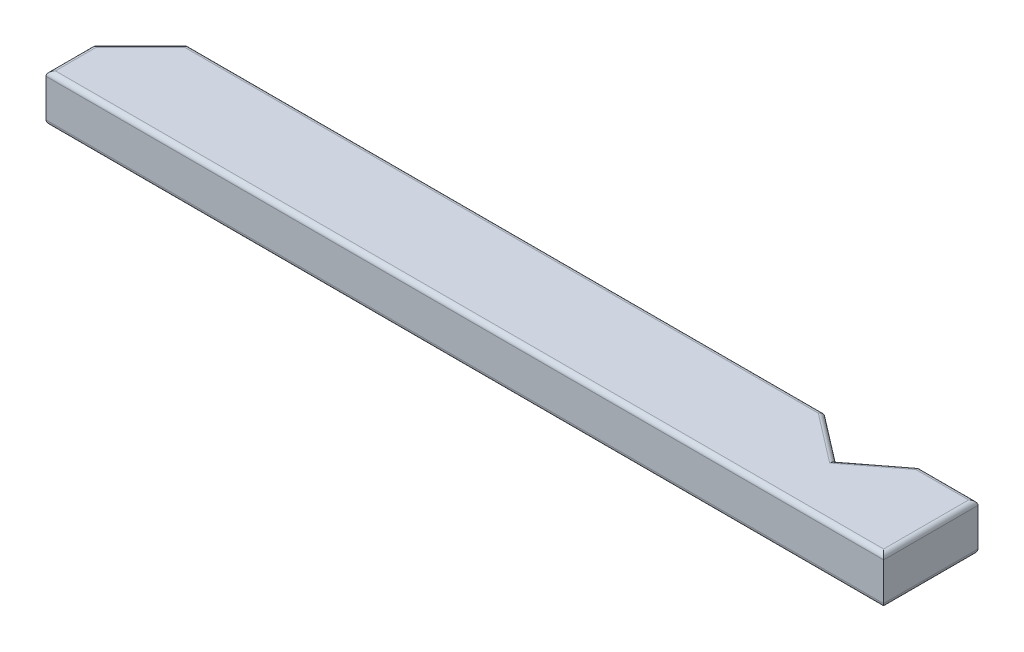
ISO-10303-21;
HEADER;
FILE_DESCRIPTION(('STEP AP214'),'2;1');
FILE_NAME('part.step','',(''),(''),'','','');
FILE_SCHEMA(('AUTOMOTIVE_DESIGN { 1 0 10303 214 1 1 1 1 }'));
ENDSEC;
DATA;
#1=APPLICATION_CONTEXT('core data for automotive mechanical design processes');
#2=APPLICATION_PROTOCOL_DEFINITION('international standard','automotive_design',2000,#1);
#3=PRODUCT_CONTEXT('',#1,'mechanical');
#4=PRODUCT('Part','Part','',(#3));
#5=PRODUCT_RELATED_PRODUCT_CATEGORY('part','',(#4));
#6=PRODUCT_DEFINITION_FORMATION('','',#4);
#7=PRODUCT_DEFINITION_CONTEXT('part definition',#1,'design');
#8=PRODUCT_DEFINITION('design','',#6,#7);
#9=PRODUCT_DEFINITION_SHAPE('','',#8);
#10=(LENGTH_UNIT() NAMED_UNIT(*) SI_UNIT(.MILLI.,.METRE.));
#11=(NAMED_UNIT(*) PLANE_ANGLE_UNIT() SI_UNIT($,.RADIAN.));
#12=(NAMED_UNIT(*) SI_UNIT($,.STERADIAN.) SOLID_ANGLE_UNIT());
#13=UNCERTAINTY_MEASURE_WITH_UNIT(LENGTH_MEASURE(1.E-05),#10,'distance_accuracy_value','');
#14=(GEOMETRIC_REPRESENTATION_CONTEXT(3) GLOBAL_UNCERTAINTY_ASSIGNED_CONTEXT((#13)) GLOBAL_UNIT_ASSIGNED_CONTEXT((#10,
#11,#12)) REPRESENTATION_CONTEXT('',''));
#15=CARTESIAN_POINT('',(0.,0.,0.));
#16=DIRECTION('',(0.,0.,1.));
#17=DIRECTION('',(1.,0.,0.));
#18=AXIS2_PLACEMENT_3D('',#15,#16,#17);
#19=CARTESIAN_POINT('',(1812.69999999996,38.1000000000061,287.69999999999));
#20=DIRECTION('',(0.,0.,-1.));
#21=DIRECTION('',(0.,1.,0.));
#22=AXIS2_PLACEMENT_3D('',#19,#20,#21);
#23=PLANE('',#22);
#24=DIRECTION('',(0.,-1.,0.));
#25=VECTOR('',#24,1.);
#26=CARTESIAN_POINT('',(2714.29999999996,38.1000000000108,287.69999999999));
#27=LINE('',#26,#25);
#28=CARTESIAN_POINT('',(2714.29999999996,33.0200000000108,287.69999999999));
#29=VERTEX_POINT('',#28);
#30=CARTESIAN_POINT('',(2714.29999999996,-7.61999999998921,287.699999999991));
#31=VERTEX_POINT('',#30);
#32=EDGE_CURVE('E196',#29,#31,#27,.T.);
#33=ORIENTED_EDGE('',*,*,#32,.T.);
#34=DIRECTION('',(1.,0.,0.));
#35=VECTOR('',#34,1.);
#36=CARTESIAN_POINT('',(2650.79999999996,-7.61999999998953,287.699999999991));
#37=LINE('',#36,#35);
#38=CARTESIAN_POINT('',(2650.79999999996,-7.61999999998953,287.699999999991));
#39=VERTEX_POINT('',#38);
#40=EDGE_CURVE('E263',#31,#39,#37,.F.);
#41=ORIENTED_EDGE('',*,*,#40,.T.);
#42=DIRECTION('',(0.,1.,0.));
#43=VECTOR('',#42,1.);
#44=CARTESIAN_POINT('',(2650.79999999996,-12.6999999999961,287.699999999991));
#45=LINE('',#44,#43);
#46=CARTESIAN_POINT('',(2650.79999999996,33.0200000000105,287.69999999999));
#47=VERTEX_POINT('',#46);
#48=EDGE_CURVE('E384',#39,#47,#45,.T.);
#49=ORIENTED_EDGE('',*,*,#48,.T.);
#50=DIRECTION('',(1.,0.,0.));
#51=VECTOR('',#50,1.);
#52=CARTESIAN_POINT('',(1812.69999999996,33.0200000000061,287.69999999999));
#53=LINE('',#52,#51);
#54=EDGE_CURVE('E260',#47,#29,#53,.T.);
#55=ORIENTED_EDGE('',*,*,#54,.T.);
#56=EDGE_LOOP('',(#33,#41,#49,#55));
#57=FACE_BOUND('',#56,.T.);
#58=ADVANCED_FACE('F43',(#57),#23,.T.);
#59=CARTESIAN_POINT('',(1812.69999999996,38.1000000000061,287.69999999999));
#60=DIRECTION('',(-1.,0.,0.));
#61=DIRECTION('',(0.,-1.,0.));
#62=AXIS2_PLACEMENT_3D('',#59,#60,#61);
#63=PLANE('',#62);
#64=DIRECTION('',(0.,1.,0.));
#65=VECTOR('',#64,1.);
#66=CARTESIAN_POINT('',(1812.69999999996,-12.6999999999996,338.499999999991));
#67=LINE('',#66,#65);
#68=CARTESIAN_POINT('',(1812.69999999996,-7.619999999993,338.499999999991));
#69=VERTEX_POINT('',#68);
#70=CARTESIAN_POINT('',(1812.69999999996,33.020000000007,338.49999999999));
#71=VERTEX_POINT('',#70);
#72=EDGE_CURVE('E364',#69,#71,#67,.T.);
#73=ORIENTED_EDGE('',*,*,#72,.F.);
#74=DIRECTION('',(0.,0.,-1.));
#75=VECTOR('',#74,1.);
#76=CARTESIAN_POINT('',(1812.69999999996,-7.61999999999208,389.299999999991));
#77=LINE('',#76,#75);
#78=CARTESIAN_POINT('',(1812.69999999996,-7.61999999999208,389.299999999991));
#79=VERTEX_POINT('',#78);
#80=EDGE_CURVE('E252',#69,#79,#77,.F.);
#81=ORIENTED_EDGE('',*,*,#80,.T.);
#82=DIRECTION('',(0.,-1.,0.));
#83=VECTOR('',#82,1.);
#84=CARTESIAN_POINT('',(1812.69999999996,38.1000000000079,389.29999999999));
#85=LINE('',#84,#83);
#86=CARTESIAN_POINT('',(1812.69999999996,33.0200000000079,389.29999999999));
#87=VERTEX_POINT('',#86);
#88=EDGE_CURVE('E189',#87,#79,#85,.T.);
#89=ORIENTED_EDGE('',*,*,#88,.F.);
#90=DIRECTION('',(0.,0.,-1.));
#91=VECTOR('',#90,1.);
#92=CARTESIAN_POINT('',(1812.69999999996,33.0200000000061,287.69999999999));
#93=LINE('',#92,#91);
#94=EDGE_CURVE('E249',#87,#71,#93,.T.);
#95=ORIENTED_EDGE('',*,*,#94,.T.);
#96=EDGE_LOOP('',(#73,#81,#89,#95));
#97=FACE_BOUND('',#96,.T.);
#98=ADVANCED_FACE('F363',(#97),#63,.T.);
#99=CARTESIAN_POINT('',(1812.69999999996,38.1000000000079,389.29999999999));
#100=DIRECTION('',(0.,0.,1.));
#101=DIRECTION('',(0.,-1.,0.));
#102=AXIS2_PLACEMENT_3D('',#99,#100,#101);
#103=PLANE('',#102);
#104=ORIENTED_EDGE('',*,*,#88,.T.);
#105=DIRECTION('',(-1.,0.,0.));
#106=VECTOR('',#105,1.);
#107=CARTESIAN_POINT('',(2714.29999999996,-7.61999999998736,389.299999999991));
#108=LINE('',#107,#106);
#109=CARTESIAN_POINT('',(2714.29999999996,-7.61999999998737,389.299999999991));
#110=VERTEX_POINT('',#109);
#111=EDGE_CURVE('E11',#79,#110,#108,.F.);
#112=ORIENTED_EDGE('',*,*,#111,.T.);
#113=DIRECTION('',(0.,-1.,0.));
#114=VECTOR('',#113,1.);
#115=CARTESIAN_POINT('',(2714.29999999996,38.1000000000126,389.29999999999));
#116=LINE('',#115,#114);
#117=CARTESIAN_POINT('',(2714.29999999996,33.0200000000126,389.29999999999));
#118=VERTEX_POINT('',#117);
#119=EDGE_CURVE('E193',#118,#110,#116,.T.);
#120=ORIENTED_EDGE('',*,*,#119,.F.);
#121=DIRECTION('',(-1.,0.,0.));
#122=VECTOR('',#121,1.);
#123=CARTESIAN_POINT('',(1812.69999999996,33.0200000000079,389.29999999999));
#124=LINE('',#123,#122);
#125=EDGE_CURVE('E53',#118,#87,#124,.T.);
#126=ORIENTED_EDGE('',*,*,#125,.T.);
#127=EDGE_LOOP('',(#104,#112,#120,#126));
#128=FACE_BOUND('',#127,.T.);
#129=ADVANCED_FACE('F425',(#128),#103,.T.);
#130=CARTESIAN_POINT('',(2714.29999999996,38.1000000000108,287.69999999999));
#131=DIRECTION('',(1.,0.,0.));
#132=DIRECTION('',(0.,1.,0.));
#133=AXIS2_PLACEMENT_3D('',#130,#131,#132);
#134=PLANE('',#133);
#135=ORIENTED_EDGE('',*,*,#119,.T.);
#136=DIRECTION('',(0.,0.,1.));
#137=VECTOR('',#136,1.);
#138=CARTESIAN_POINT('',(2714.29999999996,-7.6199999999892,287.699999999991));
#139=LINE('',#138,#137);
#140=EDGE_CURVE('E177',#110,#31,#139,.F.);
#141=ORIENTED_EDGE('',*,*,#140,.T.);
#142=ORIENTED_EDGE('',*,*,#32,.F.);
#143=DIRECTION('',(0.,0.,1.));
#144=VECTOR('',#143,1.);
#145=CARTESIAN_POINT('',(2714.29999999996,33.0200000000108,287.69999999999));
#146=LINE('',#145,#144);
#147=EDGE_CURVE('E255',#29,#118,#146,.T.);
#148=ORIENTED_EDGE('',*,*,#147,.T.);
#149=EDGE_LOOP('',(#135,#141,#142,#148));
#150=FACE_BOUND('',#149,.T.);
#151=ADVANCED_FACE('F429',(#150),#134,.T.);
#152=DIRECTION('',(0.,1.,0.));
#153=VECTOR('',#152,1.);
#154=CARTESIAN_POINT('',(1863.49999999996,-12.7000000000002,287.699999999991));
#155=LINE('',#154,#153);
#156=CARTESIAN_POINT('',(1863.49999999996,-7.61999999999365,287.699999999991));
#157=VERTEX_POINT('',#156);
#158=CARTESIAN_POINT('',(1863.49999999996,33.0200000000063,287.69999999999));
#159=VERTEX_POINT('',#158);
#160=EDGE_CURVE('E305',#157,#159,#155,.T.);
#161=ORIENTED_EDGE('',*,*,#160,.T.);
#162=DIRECTION('',(1.,0.,0.));
#163=VECTOR('',#162,1.);
#164=CARTESIAN_POINT('',(1812.69999999996,33.0200000000061,287.69999999999));
#165=LINE('',#164,#163);
#166=CARTESIAN_POINT('',(2549.19999999996,33.0200000000099,287.69999999999));
#167=VERTEX_POINT('',#166);
#168=EDGE_CURVE('E61',#159,#167,#165,.T.);
#169=ORIENTED_EDGE('',*,*,#168,.T.);
#170=DIRECTION('',(0.,1.,0.));
#171=VECTOR('',#170,1.);
#172=CARTESIAN_POINT('',(2549.19999999996,-12.6999999999966,287.699999999991));
#173=LINE('',#172,#171);
#174=CARTESIAN_POINT('',(2549.19999999996,-7.61999999999006,287.699999999991));
#175=VERTEX_POINT('',#174);
#176=EDGE_CURVE('E370',#175,#167,#173,.T.);
#177=ORIENTED_EDGE('',*,*,#176,.F.);
#178=DIRECTION('',(1.,0.,0.));
#179=VECTOR('',#178,1.);
#180=CARTESIAN_POINT('',(1863.49999999996,-7.61999999999365,287.699999999991));
#181=LINE('',#180,#179);
#182=EDGE_CURVE('E277',#175,#157,#181,.F.);
#183=ORIENTED_EDGE('',*,*,#182,.T.);
#184=EDGE_LOOP('',(#161,#169,#177,#183));
#185=FACE_BOUND('',#184,.T.);
#186=ADVANCED_FACE('F421',(#185),#23,.T.);
#187=CARTESIAN_POINT('',(-1.99195760763098E-13,38.0999999999914,-6.88847661806863E-13));
#188=DIRECTION('',(0.,1.,0.));
#189=DIRECTION('',(0.,0.,1.));
#190=AXIS2_PLACEMENT_3D('',#187,#188,#189);
#191=PLANE('',#190);
#192=DIRECTION('',(0.,0.,1.));
#193=VECTOR('',#192,1.);
#194=CARTESIAN_POINT('',(2709.21999999996,38.1000000000056,-6.88847661807119E-13));
#195=LINE('',#194,#193);
#196=CARTESIAN_POINT('',(2709.21999999996,38.1000000000125,384.21999999999));
#197=VERTEX_POINT('',#196);
#198=CARTESIAN_POINT('',(2709.21999999996,38.1000000000109,292.77999999999));
#199=VERTEX_POINT('',#198);
#200=EDGE_CURVE('E227',#197,#199,#195,.F.);
#201=ORIENTED_EDGE('',*,*,#200,.T.);
#202=DIRECTION('',(1.,0.,0.));
#203=VECTOR('',#202,1.);
#204=CARTESIAN_POINT('',(-2.3524845565551E-13,38.0999999999967,292.77999999999));
#205=LINE('',#204,#203);
#206=CARTESIAN_POINT('',(2652.52442763499,38.1000000000106,292.77999999999));
#207=VERTEX_POINT('',#206);
#208=EDGE_CURVE('E246',#199,#207,#205,.F.);
#209=ORIENTED_EDGE('',*,*,#208,.T.);
#210=DIRECTION('',(0.793353340291234,0.,-0.608761429008722));
#211=VECTOR('',#210,1.);
#212=CARTESIAN_POINT('',(2603.09250805933,38.100000000011,330.710445958001));
#213=LINE('',#212,#211);
#214=CARTESIAN_POINT('',(2599.99999999996,38.100000000011,333.083410852494));
#215=VERTEX_POINT('',#214);
#216=EDGE_CURVE('E243',#207,#215,#213,.F.);
#217=ORIENTED_EDGE('',*,*,#216,.T.);
#218=DIRECTION('',(0.793353340291234,0.,0.608761429008722));
#219=VECTOR('',#218,1.);
#220=CARTESIAN_POINT('',(2546.1074919406,38.10000000001,291.73023496867));
#221=LINE('',#220,#219);
#222=CARTESIAN_POINT('',(2547.47557236494,38.10000000001,292.77999999999));
#223=VERTEX_POINT('',#222);
#224=EDGE_CURVE('E240',#215,#223,#221,.F.);
#225=ORIENTED_EDGE('',*,*,#224,.T.);
#226=DIRECTION('',(1.,0.,0.));
#227=VECTOR('',#226,1.);
#228=CARTESIAN_POINT('',(-2.3524845565551E-13,38.0999999999967,292.77999999999));
#229=LINE('',#228,#227);
#230=CARTESIAN_POINT('',(1865.60420489682,38.1000000000064,292.77999999999));
#231=VERTEX_POINT('',#230);
#232=EDGE_CURVE('E237',#223,#231,#229,.F.);
#233=ORIENTED_EDGE('',*,*,#232,.T.);
#234=DIRECTION('',(0.707106781186551,0.,-0.707106781186544));
#235=VECTOR('',#234,1.);
#236=CARTESIAN_POINT('',(1816.29210244839,38.1000000000071,342.092102448417));
#237=LINE('',#236,#235);
#238=CARTESIAN_POINT('',(1817.77999999996,38.1000000000071,340.604204896845));
#239=VERTEX_POINT('',#238);
#240=EDGE_CURVE('E233',#231,#239,#237,.F.);
#241=ORIENTED_EDGE('',*,*,#240,.T.);
#242=DIRECTION('',(0.,0.,-1.));
#243=VECTOR('',#242,1.);
#244=CARTESIAN_POINT('',(1817.77999999996,38.1000000000009,-6.88847661807034E-13));
#245=LINE('',#244,#243);
#246=CARTESIAN_POINT('',(1817.77999999996,38.1000000000079,384.21999999999));
#247=VERTEX_POINT('',#246);
#248=EDGE_CURVE('E230',#239,#247,#245,.F.);
#249=ORIENTED_EDGE('',*,*,#248,.T.);
#250=DIRECTION('',(-1.,0.,0.));
#251=VECTOR('',#250,1.);
#252=CARTESIAN_POINT('',(-2.46508304077405E-13,38.0999999999983,384.21999999999));
#253=LINE('',#252,#251);
#254=EDGE_CURVE('E224',#247,#197,#253,.F.);
#255=ORIENTED_EDGE('',*,*,#254,.T.);
#256=EDGE_LOOP('',(#201,#209,#217,#225,#233,#241,#249,#255));
#257=FACE_BOUND('',#256,.T.);
#258=ADVANCED_FACE('F346',(#257),#191,.T.);
#259=CARTESIAN_POINT('',(0.,-12.7000000000086,2.29634020132585E-13));
#260=DIRECTION('',(0.,1.,0.));
#261=DIRECTION('',(0.,0.,1.));
#262=AXIS2_PLACEMENT_3D('',#259,#260,#261);
#263=PLANE('',#262);
#264=DIRECTION('',(0.793353340291234,0.,-0.608761429008722));
#265=VECTOR('',#264,1.);
#266=CARTESIAN_POINT('',(1124.40217579215,-12.6999999999762,1465.34944477019));
#267=LINE('',#266,#265);
#268=CARTESIAN_POINT('',(2599.99999999996,-12.699999999989,333.083410852495));
#269=VERTEX_POINT('',#268);
#270=CARTESIAN_POINT('',(2652.52442763499,-12.6999999999894,292.779999999991));
#271=VERTEX_POINT('',#270);
#272=EDGE_CURVE('E211',#269,#271,#267,.T.);
#273=ORIENTED_EDGE('',*,*,#272,.T.);
#274=DIRECTION('',(1.,0.,0.));
#275=VECTOR('',#274,1.);
#276=CARTESIAN_POINT('',(2714.29999999996,-12.6999999999891,292.779999999991));
#277=LINE('',#276,#275);
#278=CARTESIAN_POINT('',(2709.21999999996,-12.6999999999891,292.779999999991));
#279=VERTEX_POINT('',#278);
#280=EDGE_CURVE('E166',#271,#279,#277,.T.);
#281=ORIENTED_EDGE('',*,*,#280,.T.);
#282=DIRECTION('',(0.,0.,1.));
#283=VECTOR('',#282,1.);
#284=CARTESIAN_POINT('',(2709.21999999996,-12.6999999999874,389.299999999991));
#285=LINE('',#284,#283);
#286=CARTESIAN_POINT('',(2709.21999999996,-12.6999999999875,384.219999999991));
#287=VERTEX_POINT('',#286);
#288=EDGE_CURVE('E159',#279,#287,#285,.T.);
#289=ORIENTED_EDGE('',*,*,#288,.T.);
#290=DIRECTION('',(-1.,0.,0.));
#291=VECTOR('',#290,1.);
#292=CARTESIAN_POINT('',(1812.69999999996,-12.6999999999922,384.219999999991));
#293=LINE('',#292,#291);
#294=CARTESIAN_POINT('',(1817.77999999996,-12.6999999999921,384.219999999991));
#295=VERTEX_POINT('',#294);
#296=EDGE_CURVE('E163',#287,#295,#293,.T.);
#297=ORIENTED_EDGE('',*,*,#296,.T.);
#298=DIRECTION('',(0.,0.,-1.));
#299=VECTOR('',#298,1.);
#300=CARTESIAN_POINT('',(1817.77999999996,-12.699999999993,338.499999999991));
#301=LINE('',#300,#299);
#302=CARTESIAN_POINT('',(1817.77999999996,-12.6999999999929,340.604204896846));
#303=VERTEX_POINT('',#302);
#304=EDGE_CURVE('E171',#295,#303,#301,.T.);
#305=ORIENTED_EDGE('',*,*,#304,.T.);
#306=DIRECTION('',(0.707106781186551,0.,-0.707106781186544));
#307=VECTOR('',#306,1.);
#308=CARTESIAN_POINT('',(1079.1921024484,-12.6999999999834,1079.19210244841));
#309=LINE('',#308,#307);
#310=CARTESIAN_POINT('',(1865.60420489682,-12.6999999999935,292.779999999991));
#311=VERTEX_POINT('',#310);
#312=EDGE_CURVE('E201',#303,#311,#309,.T.);
#313=ORIENTED_EDGE('',*,*,#312,.T.);
#314=DIRECTION('',(1.,0.,0.));
#315=VECTOR('',#314,1.);
#316=CARTESIAN_POINT('',(2549.19999999996,-12.69999999999,292.779999999991));
#317=LINE('',#316,#315);
#318=CARTESIAN_POINT('',(2547.47557236494,-12.69999999999,292.779999999991));
#319=VERTEX_POINT('',#318);
#320=EDGE_CURVE('E205',#311,#319,#317,.T.);
#321=ORIENTED_EDGE('',*,*,#320,.T.);
#322=DIRECTION('',(0.793353340291234,0.,0.608761429008722));
#323=VECTOR('',#322,1.);
#324=CARTESIAN_POINT('',(802.668306941275,-12.7000000000233,-1046.05770358136));
#325=LINE('',#324,#323);
#326=EDGE_CURVE('E208',#319,#269,#325,.T.);
#327=ORIENTED_EDGE('',*,*,#326,.T.);
#328=EDGE_LOOP('',(#273,#281,#289,#297,#305,#313,#321,#327));
#329=FACE_BOUND('',#328,.T.);
#330=ADVANCED_FACE('F161',(#329),#263,.F.);
#331=CARTESIAN_POINT('',(1812.69999999996,-12.6999999999996,338.499999999991));
#332=DIRECTION('',(0.707106781186544,0.,0.707106781186551));
#333=DIRECTION('',(0.707106781186551,0.,-0.707106781186544));
#334=AXIS2_PLACEMENT_3D('',#331,#332,#333);
#335=PLANE('',#334);
#336=ORIENTED_EDGE('',*,*,#160,.F.);
#337=DIRECTION('',(0.707106781186551,0.,-0.707106781186544));
#338=VECTOR('',#337,1.);
#339=CARTESIAN_POINT('',(1812.69999999996,-7.619999999993,338.499999999991));
#340=LINE('',#339,#338);
#341=EDGE_CURVE('E220',#157,#69,#340,.F.);
#342=ORIENTED_EDGE('',*,*,#341,.T.);
#343=ORIENTED_EDGE('',*,*,#72,.T.);
#344=DIRECTION('',(0.707106781186551,0.,-0.707106781186544));
#345=VECTOR('',#344,1.);
#346=CARTESIAN_POINT('',(1863.49999999996,33.0200000000063,287.69999999999));
#347=LINE('',#346,#345);
#348=EDGE_CURVE('E216',#71,#159,#347,.T.);
#349=ORIENTED_EDGE('',*,*,#348,.T.);
#350=EDGE_LOOP('',(#336,#342,#343,#349));
#351=FACE_BOUND('',#350,.T.);
#352=ADVANCED_FACE('F367',(#351),#335,.F.);
#353=CARTESIAN_POINT('',(2599.99999999996,-12.6999999999956,326.680210989323));
#354=DIRECTION('',(0.608761429008722,0.,0.793353340291234));
#355=DIRECTION('',(0.793353340291234,0.,-0.608761429008722));
#356=AXIS2_PLACEMENT_3D('',#353,#354,#355);
#357=PLANE('',#356);
#358=ORIENTED_EDGE('',*,*,#48,.F.);
#359=DIRECTION('',(0.793353340291234,0.,-0.608761429008722));
#360=VECTOR('',#359,1.);
#361=CARTESIAN_POINT('',(2599.99999999996,-7.6199999999891,326.680210989323));
#362=LINE('',#361,#360);
#363=CARTESIAN_POINT('',(2599.99999999996,-7.61999999998909,326.680210989323));
#364=VERTEX_POINT('',#363);
#365=EDGE_CURVE('E269',#39,#364,#362,.F.);
#366=ORIENTED_EDGE('',*,*,#365,.T.);
#367=DIRECTION('',(0.,1.,0.));
#368=VECTOR('',#367,1.);
#369=CARTESIAN_POINT('',(2599.99999999996,-12.6999999999956,326.680210989323));
#370=LINE('',#369,#368);
#371=CARTESIAN_POINT('',(2599.99999999996,33.0200000000109,326.680210989322));
#372=VERTEX_POINT('',#371);
#373=EDGE_CURVE('E374',#364,#372,#370,.T.);
#374=ORIENTED_EDGE('',*,*,#373,.T.);
#375=DIRECTION('',(0.793353340291234,0.,-0.608761429008722));
#376=VECTOR('',#375,1.);
#377=CARTESIAN_POINT('',(2650.79999999996,33.0200000000105,287.69999999999));
#378=LINE('',#377,#376);
#379=EDGE_CURVE('E266',#372,#47,#378,.T.);
#380=ORIENTED_EDGE('',*,*,#379,.T.);
#381=EDGE_LOOP('',(#358,#366,#374,#380));
#382=FACE_BOUND('',#381,.T.);
#383=ADVANCED_FACE('F395',(#382),#357,.F.);
#384=CARTESIAN_POINT('',(2549.19999999996,-12.6999999999966,287.699999999991));
#385=DIRECTION('',(-0.608761429008722,0.,0.793353340291234));
#386=DIRECTION('',(0.793353340291234,0.,0.608761429008722));
#387=AXIS2_PLACEMENT_3D('',#384,#385,#386);
#388=PLANE('',#387);
#389=ORIENTED_EDGE('',*,*,#373,.F.);
#390=DIRECTION('',(0.793353340291234,0.,0.608761429008722));
#391=VECTOR('',#390,1.);
#392=CARTESIAN_POINT('',(2549.19999999996,-7.61999999999006,287.699999999991));
#393=LINE('',#392,#391);
#394=EDGE_CURVE('E68',#364,#175,#393,.F.);
#395=ORIENTED_EDGE('',*,*,#394,.T.);
#396=ORIENTED_EDGE('',*,*,#176,.T.);
#397=DIRECTION('',(0.793353340291234,0.,0.608761429008722));
#398=VECTOR('',#397,1.);
#399=CARTESIAN_POINT('',(2599.99999999996,33.0200000000109,326.680210989322));
#400=LINE('',#399,#398);
#401=EDGE_CURVE('E272',#167,#372,#400,.T.);
#402=ORIENTED_EDGE('',*,*,#401,.T.);
#403=EDGE_LOOP('',(#389,#395,#396,#402));
#404=FACE_BOUND('',#403,.T.);
#405=ADVANCED_FACE('F459',(#404),#388,.F.);
#406=CARTESIAN_POINT('',(0.,-7.62000000000331,292.779999999991));
#407=DIRECTION('',(-1.,0.,0.));
#408=DIRECTION('',(0.,-1.,0.));
#409=AXIS2_PLACEMENT_3D('',#406,#407,#408);
#410=CYLINDRICAL_SURFACE('',#409,5.08);
#411=CARTESIAN_POINT('',(2652.52442763499,-7.61999999998943,292.779999999991));
#412=DIRECTION('',(0.946930129495105,0.,-0.321439465303162));
#413=DIRECTION('',(-0.321439465303163,0.,-0.946930129495105));
#414=AXIS2_PLACEMENT_3D('',#411,#412,#413);
#415=ELLIPSE('',#414,5.36470415479188,5.08);
#416=EDGE_CURVE('E181',#39,#271,#415,.F.);
#417=ORIENTED_EDGE('',*,*,#416,.F.);
#418=ORIENTED_EDGE('',*,*,#40,.F.);
#419=CARTESIAN_POINT('',(2709.21999999996,-7.61999999998914,292.779999999991));
#420=DIRECTION('',(-0.707106781186547,0.,-0.707106781186548));
#421=DIRECTION('',(-0.707106781186548,0.,0.707106781186547));
#422=AXIS2_PLACEMENT_3D('',#419,#420,#421);
#423=ELLIPSE('',#422,7.18420489685532,5.08);
#424=EDGE_CURVE('E302',#279,#31,#423,.F.);
#425=ORIENTED_EDGE('',*,*,#424,.F.);
#426=ORIENTED_EDGE('',*,*,#280,.F.);
#427=EDGE_LOOP('',(#417,#418,#425,#426));
#428=FACE_BOUND('',#427,.T.);
#429=ADVANCED_FACE('F462',(#428),#410,.T.);
#430=CARTESIAN_POINT('',(2709.21999999996,-7.61999999999443,1.37780412079357E-13));
#431=DIRECTION('',(0.,0.,-1.));
#432=DIRECTION('',(0.,1.,0.));
#433=AXIS2_PLACEMENT_3D('',#430,#431,#432);
#434=CYLINDRICAL_SURFACE('',#433,5.08);
#435=ORIENTED_EDGE('',*,*,#424,.T.);
#436=ORIENTED_EDGE('',*,*,#140,.F.);
#437=CARTESIAN_POINT('',(2709.21999999996,-7.61999999998748,384.219999999991));
#438=DIRECTION('',(0.707106781186548,0.,-0.707106781186547));
#439=DIRECTION('',(0.707106781186547,0.,0.707106781186548));
#440=AXIS2_PLACEMENT_3D('',#437,#438,#439);
#441=ELLIPSE('',#440,7.18420489685532,5.08);
#442=EDGE_CURVE('E175',#287,#110,#441,.F.);
#443=ORIENTED_EDGE('',*,*,#442,.F.);
#444=ORIENTED_EDGE('',*,*,#288,.F.);
#445=EDGE_LOOP('',(#435,#436,#443,#444));
#446=FACE_BOUND('',#445,.T.);
#447=ADVANCED_FACE('F176',(#446),#434,.T.);
#448=CARTESIAN_POINT('',(1124.40217579215,-7.61999999997622,1465.34944477019));
#449=DIRECTION('',(0.793353340291234,0.,-0.608761429008722));
#450=DIRECTION('',(-0.608761429008722,0.,-0.793353340291234));
#451=AXIS2_PLACEMENT_3D('',#448,#449,#450);
#452=CYLINDRICAL_SURFACE('',#451,5.08);
#453=ORIENTED_EDGE('',*,*,#416,.T.);
#454=ORIENTED_EDGE('',*,*,#272,.F.);
#455=CARTESIAN_POINT('',(2599.99999999996,-7.61999999998898,333.083410852495));
#456=DIRECTION('',(1.,0.,0.));
#457=DIRECTION('',(0.,0.,-1.));
#458=AXIS2_PLACEMENT_3D('',#455,#456,#457);
#459=ELLIPSE('',#458,6.40319986317215,5.08);
#460=EDGE_CURVE('E182',#364,#269,#459,.F.);
#461=ORIENTED_EDGE('',*,*,#460,.F.);
#462=ORIENTED_EDGE('',*,*,#365,.F.);
#463=EDGE_LOOP('',(#453,#454,#461,#462));
#464=FACE_BOUND('',#463,.T.);
#465=ADVANCED_FACE('F485',(#464),#452,.T.);
#466=CARTESIAN_POINT('',(0.,-7.62000000000165,384.219999999991));
#467=DIRECTION('',(1.,0.,0.));
#468=DIRECTION('',(0.,1.,0.));
#469=AXIS2_PLACEMENT_3D('',#466,#467,#468);
#470=CYLINDRICAL_SURFACE('',#469,5.08);
#471=ORIENTED_EDGE('',*,*,#442,.T.);
#472=ORIENTED_EDGE('',*,*,#111,.F.);
#473=CARTESIAN_POINT('',(1817.77999999996,-7.61999999999214,384.219999999991));
#474=DIRECTION('',(0.707106781186547,0.,0.707106781186548));
#475=DIRECTION('',(0.707106781186548,0.,-0.707106781186547));
#476=AXIS2_PLACEMENT_3D('',#473,#474,#475);
#477=ELLIPSE('',#476,7.18420489685532,5.08);
#478=EDGE_CURVE('E186',#295,#79,#477,.F.);
#479=ORIENTED_EDGE('',*,*,#478,.F.);
#480=ORIENTED_EDGE('',*,*,#296,.F.);
#481=EDGE_LOOP('',(#471,#472,#479,#480));
#482=FACE_BOUND('',#481,.T.);
#483=ADVANCED_FACE('F184',(#482),#470,.T.);
#484=CARTESIAN_POINT('',(802.668306941275,-7.62000000002331,-1046.05770358136));
#485=DIRECTION('',(0.793353340291234,0.,0.608761429008722));
#486=DIRECTION('',(0.608761429008722,0.,-0.793353340291234));
#487=AXIS2_PLACEMENT_3D('',#484,#485,#486);
#488=CYLINDRICAL_SURFACE('',#487,5.08);
#489=ORIENTED_EDGE('',*,*,#460,.T.);
#490=ORIENTED_EDGE('',*,*,#326,.F.);
#491=CARTESIAN_POINT('',(2547.47557236494,-7.61999999998998,292.779999999991));
#492=DIRECTION('',(-0.946930129495105,0.,-0.321439465303162));
#493=DIRECTION('',(-0.321439465303163,0.,0.946930129495105));
#494=AXIS2_PLACEMENT_3D('',#491,#492,#493);
#495=ELLIPSE('',#494,5.36470415479188,5.08);
#496=EDGE_CURVE('E290',#175,#319,#495,.T.);
#497=ORIENTED_EDGE('',*,*,#496,.F.);
#498=ORIENTED_EDGE('',*,*,#394,.F.);
#499=EDGE_LOOP('',(#489,#490,#497,#498));
#500=FACE_BOUND('',#499,.T.);
#501=ADVANCED_FACE('F499',(#500),#488,.T.);
#502=CARTESIAN_POINT('',(1817.77999999996,-7.61999999999909,1.37780412079441E-13));
#503=DIRECTION('',(0.,0.,1.));
#504=DIRECTION('',(0.,-1.,0.));
#505=AXIS2_PLACEMENT_3D('',#502,#503,#504);
#506=CYLINDRICAL_SURFACE('',#505,5.08);
#507=ORIENTED_EDGE('',*,*,#478,.T.);
#508=ORIENTED_EDGE('',*,*,#80,.F.);
#509=CARTESIAN_POINT('',(1817.77999999996,-7.61999999999293,340.604204896846));
#510=DIRECTION('',(-0.382683432365092,0.,0.923879532511286));
#511=DIRECTION('',(0.923879532511286,0.,0.382683432365092));
#512=AXIS2_PLACEMENT_3D('',#509,#510,#511);
#513=ELLIPSE('',#512,5.49855237748537,5.08);
#514=EDGE_CURVE('E287',#303,#69,#513,.F.);
#515=ORIENTED_EDGE('',*,*,#514,.F.);
#516=ORIENTED_EDGE('',*,*,#304,.F.);
#517=EDGE_LOOP('',(#507,#508,#515,#516));
#518=FACE_BOUND('',#517,.T.);
#519=ADVANCED_FACE('F448',(#518),#506,.T.);
#520=CARTESIAN_POINT('',(0.,-7.62000000000331,292.779999999991));
#521=DIRECTION('',(-1.,0.,0.));
#522=DIRECTION('',(0.,-1.,0.));
#523=AXIS2_PLACEMENT_3D('',#520,#521,#522);
#524=CYLINDRICAL_SURFACE('',#523,5.08);
#525=ORIENTED_EDGE('',*,*,#496,.T.);
#526=ORIENTED_EDGE('',*,*,#320,.F.);
#527=CARTESIAN_POINT('',(1865.60420489682,-7.61999999999355,292.779999999991));
#528=DIRECTION('',(-0.923879532511288,0.,0.382683432365087));
#529=DIRECTION('',(-0.382683432365087,0.,-0.923879532511288));
#530=AXIS2_PLACEMENT_3D('',#527,#528,#529);
#531=ELLIPSE('',#530,5.49855237748536,5.08);
#532=EDGE_CURVE('E284',#157,#311,#531,.T.);
#533=ORIENTED_EDGE('',*,*,#532,.F.);
#534=ORIENTED_EDGE('',*,*,#182,.F.);
#535=EDGE_LOOP('',(#525,#526,#533,#534));
#536=FACE_BOUND('',#535,.T.);
#537=ADVANCED_FACE('F444',(#536),#524,.T.);
#538=CARTESIAN_POINT('',(1079.1921024484,-7.61999999998344,1079.19210244841));
#539=DIRECTION('',(0.707106781186551,0.,-0.707106781186544));
#540=DIRECTION('',(-0.707106781186544,0.,-0.707106781186551));
#541=AXIS2_PLACEMENT_3D('',#538,#539,#540);
#542=CYLINDRICAL_SURFACE('',#541,5.08);
#543=ORIENTED_EDGE('',*,*,#514,.T.);
#544=ORIENTED_EDGE('',*,*,#341,.F.);
#545=ORIENTED_EDGE('',*,*,#532,.T.);
#546=ORIENTED_EDGE('',*,*,#312,.F.);
#547=EDGE_LOOP('',(#543,#544,#545,#546));
#548=FACE_BOUND('',#547,.T.);
#549=ADVANCED_FACE('F438',(#548),#542,.T.);
#550=CARTESIAN_POINT('',(1812.69999999996,33.0200000000062,292.77999999999));
#551=DIRECTION('',(1.,0.,0.));
#552=DIRECTION('',(0.,1.,0.));
#553=AXIS2_PLACEMENT_3D('',#550,#551,#552);
#554=CYLINDRICAL_SURFACE('',#553,5.08);
#555=CARTESIAN_POINT('',(2652.52442763499,33.0200000000106,292.77999999999));
#556=DIRECTION('',(-0.946930129495105,0.,0.321439465303162));
#557=DIRECTION('',(0.321439465303163,0.,0.946930129495105));
#558=AXIS2_PLACEMENT_3D('',#555,#556,#557);
#559=ELLIPSE('',#558,5.36470415479188,5.08);
#560=EDGE_CURVE('E327',#207,#47,#559,.T.);
#561=ORIENTED_EDGE('',*,*,#560,.F.);
#562=ORIENTED_EDGE('',*,*,#208,.F.);
#563=CARTESIAN_POINT('',(2709.21999999996,33.0200000000109,292.77999999999));
#564=DIRECTION('',(0.707106781186547,0.,0.707106781186548));
#565=DIRECTION('',(0.707106781186548,0.,-0.707106781186547));
#566=AXIS2_PLACEMENT_3D('',#563,#564,#565);
#567=ELLIPSE('',#566,7.18420489685532,5.08);
#568=EDGE_CURVE('E47',#29,#199,#567,.T.);
#569=ORIENTED_EDGE('',*,*,#568,.F.);
#570=ORIENTED_EDGE('',*,*,#54,.F.);
#571=EDGE_LOOP('',(#561,#562,#569,#570));
#572=FACE_BOUND('',#571,.T.);
#573=ADVANCED_FACE('F45',(#572),#554,.T.);
#574=CARTESIAN_POINT('',(2709.21999999996,33.0200000000108,287.69999999999));
#575=DIRECTION('',(0.,0.,1.));
#576=DIRECTION('',(0.,-1.,0.));
#577=AXIS2_PLACEMENT_3D('',#574,#575,#576);
#578=CYLINDRICAL_SURFACE('',#577,5.08);
#579=ORIENTED_EDGE('',*,*,#568,.T.);
#580=ORIENTED_EDGE('',*,*,#200,.F.);
#581=CARTESIAN_POINT('',(2709.21999999996,33.0200000000125,384.219999999991));
#582=DIRECTION('',(-0.707106781186548,0.,0.707106781186547));
#583=DIRECTION('',(-0.707106781186547,0.,-0.707106781186548));
#584=AXIS2_PLACEMENT_3D('',#581,#582,#583);
#585=ELLIPSE('',#584,7.18420489685532,5.08);
#586=EDGE_CURVE('E324',#118,#197,#585,.T.);
#587=ORIENTED_EDGE('',*,*,#586,.F.);
#588=ORIENTED_EDGE('',*,*,#147,.F.);
#589=EDGE_LOOP('',(#579,#580,#587,#588));
#590=FACE_BOUND('',#589,.T.);
#591=ADVANCED_FACE('F340',(#590),#578,.T.);
#592=CARTESIAN_POINT('',(2603.09250805933,33.020000000011,330.710445958001));
#593=DIRECTION('',(-0.793353340291234,0.,0.608761429008722));
#594=DIRECTION('',(0.608761429008722,0.,0.793353340291234));
#595=AXIS2_PLACEMENT_3D('',#592,#593,#594);
#596=CYLINDRICAL_SURFACE('',#595,5.08);
#597=ORIENTED_EDGE('',*,*,#560,.T.);
#598=ORIENTED_EDGE('',*,*,#379,.F.);
#599=CARTESIAN_POINT('',(2599.99999999996,33.020000000011,333.083410852494));
#600=DIRECTION('',(-1.,0.,0.));
#601=DIRECTION('',(0.,0.,1.));
#602=AXIS2_PLACEMENT_3D('',#599,#600,#601);
#603=ELLIPSE('',#602,6.40319986317215,5.08);
#604=EDGE_CURVE('E320',#215,#372,#603,.T.);
#605=ORIENTED_EDGE('',*,*,#604,.F.);
#606=ORIENTED_EDGE('',*,*,#216,.F.);
#607=EDGE_LOOP('',(#597,#598,#605,#606));
#608=FACE_BOUND('',#607,.T.);
#609=ADVANCED_FACE('F398',(#608),#596,.T.);
#610=CARTESIAN_POINT('',(1812.69999999996,33.0200000000078,384.21999999999));
#611=DIRECTION('',(-1.,0.,0.));
#612=DIRECTION('',(0.,-1.,0.));
#613=AXIS2_PLACEMENT_3D('',#610,#611,#612);
#614=CYLINDRICAL_SURFACE('',#613,5.08);
#615=ORIENTED_EDGE('',*,*,#586,.T.);
#616=ORIENTED_EDGE('',*,*,#254,.F.);
#617=CARTESIAN_POINT('',(1817.77999999996,33.0200000000078,384.21999999999));
#618=DIRECTION('',(-0.707106781186547,0.,-0.707106781186548));
#619=DIRECTION('',(-0.707106781186548,0.,0.707106781186547));
#620=AXIS2_PLACEMENT_3D('',#617,#618,#619);
#621=ELLIPSE('',#620,7.18420489685532,5.08);
#622=EDGE_CURVE('E316',#87,#247,#621,.T.);
#623=ORIENTED_EDGE('',*,*,#622,.F.);
#624=ORIENTED_EDGE('',*,*,#125,.F.);
#625=EDGE_LOOP('',(#615,#616,#623,#624));
#626=FACE_BOUND('',#625,.T.);
#627=ADVANCED_FACE('F352',(#626),#614,.T.);
#628=CARTESIAN_POINT('',(2546.1074919406,33.02000000001,291.73023496867));
#629=DIRECTION('',(-0.793353340291234,0.,-0.608761429008722));
#630=DIRECTION('',(-0.608761429008722,0.,0.793353340291234));
#631=AXIS2_PLACEMENT_3D('',#628,#629,#630);
#632=CYLINDRICAL_SURFACE('',#631,5.08);
#633=ORIENTED_EDGE('',*,*,#604,.T.);
#634=ORIENTED_EDGE('',*,*,#401,.F.);
#635=CARTESIAN_POINT('',(2547.47557236494,33.02000000001,292.77999999999));
#636=DIRECTION('',(0.946930129495105,0.,0.321439465303162));
#637=DIRECTION('',(0.321439465303163,0.,-0.946930129495105));
#638=AXIS2_PLACEMENT_3D('',#635,#636,#637);
#639=ELLIPSE('',#638,5.36470415479188,5.08);
#640=EDGE_CURVE('E312',#223,#167,#639,.F.);
#641=ORIENTED_EDGE('',*,*,#640,.F.);
#642=ORIENTED_EDGE('',*,*,#224,.F.);
#643=EDGE_LOOP('',(#633,#634,#641,#642));
#644=FACE_BOUND('',#643,.T.);
#645=ADVANCED_FACE('F402',(#644),#632,.T.);
#646=CARTESIAN_POINT('',(1817.77999999996,33.0200000000061,287.69999999999));
#647=DIRECTION('',(0.,0.,-1.));
#648=DIRECTION('',(0.,1.,0.));
#649=AXIS2_PLACEMENT_3D('',#646,#647,#648);
#650=CYLINDRICAL_SURFACE('',#649,5.08);
#651=ORIENTED_EDGE('',*,*,#622,.T.);
#652=ORIENTED_EDGE('',*,*,#248,.F.);
#653=CARTESIAN_POINT('',(1817.77999999996,33.0200000000071,340.604204896845));
#654=DIRECTION('',(0.382683432365092,0.,-0.923879532511286));
#655=DIRECTION('',(-0.923879532511286,0.,-0.382683432365092));
#656=AXIS2_PLACEMENT_3D('',#653,#654,#655);
#657=ELLIPSE('',#656,5.49855237748537,5.08);
#658=EDGE_CURVE('E309',#71,#239,#657,.T.);
#659=ORIENTED_EDGE('',*,*,#658,.F.);
#660=ORIENTED_EDGE('',*,*,#94,.F.);
#661=EDGE_LOOP('',(#651,#652,#659,#660));
#662=FACE_BOUND('',#661,.T.);
#663=ADVANCED_FACE('F356',(#662),#650,.T.);
#664=CARTESIAN_POINT('',(1812.69999999996,33.0200000000062,292.77999999999));
#665=DIRECTION('',(1.,0.,0.));
#666=DIRECTION('',(0.,1.,0.));
#667=AXIS2_PLACEMENT_3D('',#664,#665,#666);
#668=CYLINDRICAL_SURFACE('',#667,5.08);
#669=ORIENTED_EDGE('',*,*,#640,.T.);
#670=ORIENTED_EDGE('',*,*,#168,.F.);
#671=CARTESIAN_POINT('',(1865.60420489682,33.0200000000064,292.77999999999));
#672=DIRECTION('',(0.923879532511288,0.,-0.382683432365087));
#673=DIRECTION('',(0.382683432365087,0.,0.923879532511288));
#674=AXIS2_PLACEMENT_3D('',#671,#672,#673);
#675=ELLIPSE('',#674,5.49855237748536,5.08);
#676=EDGE_CURVE('E306',#231,#159,#675,.F.);
#677=ORIENTED_EDGE('',*,*,#676,.F.);
#678=ORIENTED_EDGE('',*,*,#232,.F.);
#679=EDGE_LOOP('',(#669,#670,#677,#678));
#680=FACE_BOUND('',#679,.T.);
#681=ADVANCED_FACE('F410',(#680),#668,.T.);
#682=CARTESIAN_POINT('',(1816.29210244839,33.0200000000071,342.092102448418));
#683=DIRECTION('',(-0.707106781186551,0.,0.707106781186544));
#684=DIRECTION('',(0.707106781186544,0.,0.707106781186551));
#685=AXIS2_PLACEMENT_3D('',#682,#683,#684);
#686=CYLINDRICAL_SURFACE('',#685,5.08);
#687=ORIENTED_EDGE('',*,*,#658,.T.);
#688=ORIENTED_EDGE('',*,*,#240,.F.);
#689=ORIENTED_EDGE('',*,*,#676,.T.);
#690=ORIENTED_EDGE('',*,*,#348,.F.);
#691=EDGE_LOOP('',(#687,#688,#689,#690));
#692=FACE_BOUND('',#691,.T.);
#693=ADVANCED_FACE('F409',(#692),#686,.T.);
#694=CLOSED_SHELL('',(#58,#98,#129,#151,#186,#258,#330,#352,#383,#405,#429,#447,#465,#483,#501,
#519,#537,#549,#573,#591,#609,#627,#645,#663,#681,#693));
#695=MANIFOLD_SOLID_BREP('B2',#694);
#696=ADVANCED_BREP_SHAPE_REPRESENTATION('',(#18,#695),#14);
#697=SHAPE_DEFINITION_REPRESENTATION(#9,#696);
ENDSEC;
END-ISO-10303-21;
